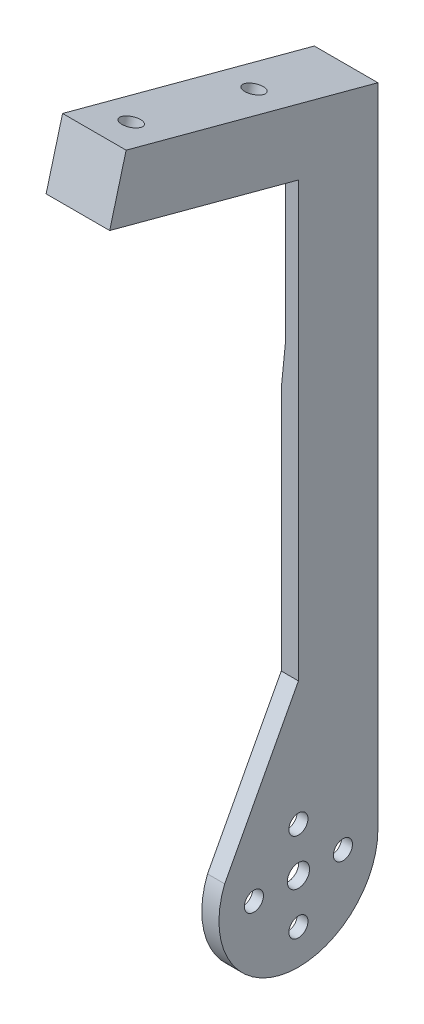
ISO-10303-21;
HEADER;
FILE_DESCRIPTION(('STEP AP214'),'2;1');
FILE_NAME('part.step','',(''),(''),'','','');
FILE_SCHEMA(('AUTOMOTIVE_DESIGN { 1 0 10303 214 1 1 1 1 }'));
ENDSEC;
DATA;
#1=APPLICATION_CONTEXT('core data for automotive mechanical design processes');
#2=APPLICATION_PROTOCOL_DEFINITION('international standard','automotive_design',2000,#1);
#3=PRODUCT_CONTEXT('',#1,'mechanical');
#4=PRODUCT('Part','Part','',(#3));
#5=PRODUCT_RELATED_PRODUCT_CATEGORY('part','',(#4));
#6=PRODUCT_DEFINITION_FORMATION('','',#4);
#7=PRODUCT_DEFINITION_CONTEXT('part definition',#1,'design');
#8=PRODUCT_DEFINITION('design','',#6,#7);
#9=PRODUCT_DEFINITION_SHAPE('','',#8);
#10=(LENGTH_UNIT() NAMED_UNIT(*) SI_UNIT(.MILLI.,.METRE.));
#11=(NAMED_UNIT(*) PLANE_ANGLE_UNIT() SI_UNIT($,.RADIAN.));
#12=(NAMED_UNIT(*) SI_UNIT($,.STERADIAN.) SOLID_ANGLE_UNIT());
#13=UNCERTAINTY_MEASURE_WITH_UNIT(LENGTH_MEASURE(1.E-05),#10,'distance_accuracy_value','');
#14=(GEOMETRIC_REPRESENTATION_CONTEXT(3) GLOBAL_UNCERTAINTY_ASSIGNED_CONTEXT((#13)) GLOBAL_UNIT_ASSIGNED_CONTEXT((#10,
#11,#12)) REPRESENTATION_CONTEXT('',''));
#15=CARTESIAN_POINT('',(0.,0.,0.));
#16=DIRECTION('',(0.,0.,1.));
#17=DIRECTION('',(1.,0.,0.));
#18=AXIS2_PLACEMENT_3D('',#15,#16,#17);
#19=CARTESIAN_POINT('',(41.627689185406,93.7654447363284,32.7931913280391));
#20=DIRECTION('',(-0.995037190209989,0.0995037190210029,0.));
#21=DIRECTION('',(0.,0.,1.));
#22=AXIS2_PLACEMENT_3D('',#19,#20,#21);
#23=PLANE('',#22);
#24=DIRECTION('',(-0.0995037190210029,-0.995037190209989,0.));
#25=VECTOR('',#24,1.);
#26=CARTESIAN_POINT('',(37.7447683933264,54.9362368155364,20.2931913280394));
#27=LINE('',#26,#25);
#28=CARTESIAN_POINT('',(41.9776891854057,97.2654447363283,20.2931913280393));
#29=VERTEX_POINT('',#28);
#30=CARTESIAN_POINT('',(41.2776891854058,90.2654447363284,20.2931913280395));
#31=VERTEX_POINT('',#30);
#32=EDGE_CURVE('E236',#29,#31,#27,.T.);
#33=ORIENTED_EDGE('',*,*,#32,.T.);
#34=DIRECTION('',(0.,0.,1.));
#35=VECTOR('',#34,1.);
#36=CARTESIAN_POINT('',(41.277689185406,90.2654447363284,32.7931913280392));
#37=LINE('',#36,#35);
#38=CARTESIAN_POINT('',(41.277689185406,90.2654447363284,32.7931913280395));
#39=VERTEX_POINT('',#38);
#40=EDGE_CURVE('E11',#31,#39,#37,.T.);
#41=ORIENTED_EDGE('',*,*,#40,.T.);
#42=DIRECTION('',(0.0995037190210029,0.995037190209989,0.));
#43=VECTOR('',#42,1.);
#44=CARTESIAN_POINT('',(43.1903129477823,109.391682360091,32.7931913280393));
#45=LINE('',#44,#43);
#46=CARTESIAN_POINT('',(41.9776891854059,97.2654447363283,32.7931913280389));
#47=VERTEX_POINT('',#46);
#48=EDGE_CURVE('E186',#39,#47,#45,.T.);
#49=ORIENTED_EDGE('',*,*,#48,.T.);
#50=DIRECTION('',(0.,0.,-1.));
#51=VECTOR('',#50,1.);
#52=CARTESIAN_POINT('',(41.9776891854057,97.2654447363283,20.2931913280393));
#53=LINE('',#52,#51);
#54=EDGE_CURVE('E235',#47,#29,#53,.T.);
#55=ORIENTED_EDGE('',*,*,#54,.T.);
#56=EDGE_LOOP('',(#33,#41,#49,#55));
#57=FACE_BOUND('',#56,.T.);
#58=ADVANCED_FACE('F36',(#57),#23,.T.);
#59=CARTESIAN_POINT('',(41.2776891854059,64.0154447363285,32.7931913280395));
#60=DIRECTION('',(-1.,0.,0.));
#61=DIRECTION('',(0.,1.,0.));
#62=AXIS2_PLACEMENT_3D('',#59,#60,#61);
#63=PLANE('',#62);
#64=CARTESIAN_POINT('',(41.2776891854056,25.2654447363286,32.7931913280394));
#65=DIRECTION('',(-1.,0.,0.));
#66=DIRECTION('',(0.,0.,1.));
#67=AXIS2_PLACEMENT_3D('',#64,#65,#66);
#68=CIRCLE('',#67,10.15);
#69=CARTESIAN_POINT('',(41.2776891854058,25.2654447363286,42.9431913280394));
#70=VERTEX_POINT('',#69);
#71=EDGE_CURVE('E251',#70,#70,#68,.T.);
#72=ORIENTED_EDGE('',*,*,#71,.F.);
#73=EDGE_LOOP('',(#72));
#74=FACE_BOUND('',#73,.T.);
#75=DIRECTION('',(0.,1.,0.));
#76=VECTOR('',#75,1.);
#77=CARTESIAN_POINT('',(41.2776891854057,27.7654447363286,32.7931913280395));
#78=LINE('',#77,#76);
#79=CARTESIAN_POINT('',(41.2776891854058,51.7654447363286,32.7931913280395));
#80=VERTEX_POINT('',#79);
#81=EDGE_CURVE('E166',#80,#39,#78,.T.);
#82=ORIENTED_EDGE('',*,*,#81,.T.);
#83=ORIENTED_EDGE('',*,*,#40,.F.);
#84=DIRECTION('',(0.,1.,0.));
#85=VECTOR('',#84,1.);
#86=CARTESIAN_POINT('',(41.2776891854059,135.265444736329,20.2931913280394));
#87=LINE('',#86,#85);
#88=CARTESIAN_POINT('',(41.2776891854055,25.2654447363286,20.2931913280395));
#89=VERTEX_POINT('',#88);
#90=EDGE_CURVE('E239',#89,#31,#87,.T.);
#91=ORIENTED_EDGE('',*,*,#90,.F.);
#92=CARTESIAN_POINT('',(41.2776891854057,25.2654447363286,32.7931913280395));
#93=DIRECTION('',(-1.,0.,0.));
#94=DIRECTION('',(0.,0.,-1.));
#95=AXIS2_PLACEMENT_3D('',#92,#93,#94);
#96=CIRCLE('',#95,12.5);
#97=CARTESIAN_POINT('',(41.2776891854059,29.9254447363286,44.3920878272759));
#98=VERTEX_POINT('',#97);
#99=EDGE_CURVE('E169',#89,#98,#96,.T.);
#100=ORIENTED_EDGE('',*,*,#99,.T.);
#101=DIRECTION('',(0.,-0.883176086632785,0.469041575982343));
#102=VECTOR('',#101,1.);
#103=CARTESIAN_POINT('',(41.2776891854058,54.9829447363286,31.0844253259198));
#104=LINE('',#103,#102);
#105=EDGE_CURVE('E162',#80,#98,#104,.T.);
#106=ORIENTED_EDGE('',*,*,#105,.F.);
#107=EDGE_LOOP('',(#82,#83,#91,#100,#106));
#108=FACE_BOUND('',#107,.T.);
#109=ADVANCED_FACE('F164',(#74,#108),#63,.T.);
#110=CARTESIAN_POINT('',(42.2776891854058,74.0154447363286,32.7931913280394));
#111=DIRECTION('',(1.,0.,0.));
#112=DIRECTION('',(0.,0.,-1.));
#113=AXIS2_PLACEMENT_3D('',#110,#111,#112);
#114=PLANE('',#113);
#115=CARTESIAN_POINT('',(42.2776891854057,25.2654447363286,39.7931914323475));
#116=DIRECTION('',(-1.,0.,0.));
#117=DIRECTION('',(0.,-1.,0.));
#118=AXIS2_PLACEMENT_3D('',#115,#116,#117);
#119=CIRCLE('',#118,1.5);
#120=CARTESIAN_POINT('',(42.2776891854057,26.7654447363286,39.7931914323475));
#121=VERTEX_POINT('',#120);
#122=EDGE_CURVE('E227',#121,#121,#119,.T.);
#123=ORIENTED_EDGE('',*,*,#122,.F.);
#124=EDGE_LOOP('',(#123));
#125=FACE_BOUND('',#124,.T.);
#126=CARTESIAN_POINT('',(42.2776891854056,32.2654448406367,32.7931913280394));
#127=DIRECTION('',(-1.,0.,0.));
#128=DIRECTION('',(0.,-1.,0.));
#129=AXIS2_PLACEMENT_3D('',#126,#127,#128);
#130=CIRCLE('',#129,1.5);
#131=CARTESIAN_POINT('',(42.2776891854056,33.7654448406367,32.7931913280394));
#132=VERTEX_POINT('',#131);
#133=EDGE_CURVE('E226',#132,#132,#130,.T.);
#134=ORIENTED_EDGE('',*,*,#133,.F.);
#135=EDGE_LOOP('',(#134));
#136=FACE_BOUND('',#135,.T.);
#137=CARTESIAN_POINT('',(42.2776891854055,25.2654447363286,25.7931912237313));
#138=DIRECTION('',(-1.,0.,0.));
#139=DIRECTION('',(0.,-1.,0.));
#140=AXIS2_PLACEMENT_3D('',#137,#138,#139);
#141=CIRCLE('',#140,1.5);
#142=CARTESIAN_POINT('',(42.2776891854055,26.7654447363286,25.7931912237313));
#143=VERTEX_POINT('',#142);
#144=EDGE_CURVE('E278',#143,#143,#141,.T.);
#145=ORIENTED_EDGE('',*,*,#144,.F.);
#146=EDGE_LOOP('',(#145));
#147=FACE_BOUND('',#146,.T.);
#148=CARTESIAN_POINT('',(42.2776891854056,25.2654447363286,32.7931913280394));
#149=DIRECTION('',(-1.,0.,0.));
#150=DIRECTION('',(0.,-1.,0.));
#151=AXIS2_PLACEMENT_3D('',#148,#149,#150);
#152=CIRCLE('',#151,1.75);
#153=CARTESIAN_POINT('',(42.2776891854056,27.0154447363286,32.7931913280394));
#154=VERTEX_POINT('',#153);
#155=EDGE_CURVE('E222',#154,#154,#152,.T.);
#156=ORIENTED_EDGE('',*,*,#155,.F.);
#157=EDGE_LOOP('',(#156));
#158=FACE_BOUND('',#157,.T.);
#159=CARTESIAN_POINT('',(42.2776891854056,18.2654446320205,32.7931913280394));
#160=DIRECTION('',(-1.,0.,0.));
#161=DIRECTION('',(0.,-1.,0.));
#162=AXIS2_PLACEMENT_3D('',#159,#160,#161);
#163=CIRCLE('',#162,1.5);
#164=CARTESIAN_POINT('',(42.2776891854056,19.7654446320205,32.7931913280394));
#165=VERTEX_POINT('',#164);
#166=EDGE_CURVE('E46',#165,#165,#163,.T.);
#167=ORIENTED_EDGE('',*,*,#166,.F.);
#168=EDGE_LOOP('',(#167));
#169=FACE_BOUND('',#168,.T.);
#170=CARTESIAN_POINT('',(42.2776891854056,25.2654447363286,32.7931913280394));
#171=DIRECTION('',(-1.,0.,0.));
#172=DIRECTION('',(0.,0.,1.));
#173=AXIS2_PLACEMENT_3D('',#170,#171,#172);
#174=CIRCLE('',#173,10.15);
#175=CARTESIAN_POINT('',(42.2776891854058,25.2654447363286,42.9431913280394));
#176=VERTEX_POINT('',#175);
#177=EDGE_CURVE('E586',#176,#176,#174,.T.);
#178=ORIENTED_EDGE('',*,*,#177,.T.);
#179=EDGE_LOOP('',(#178));
#180=FACE_BOUND('',#179,.T.);
#181=ADVANCED_FACE('F373',(#125,#136,#147,#158,#169,#180),#114,.F.);
#182=CARTESIAN_POINT('',(42.2776891854056,18.2654446320205,32.7931913280394));
#183=DIRECTION('',(1.,0.,0.));
#184=DIRECTION('',(0.,-1.,0.));
#185=AXIS2_PLACEMENT_3D('',#182,#183,#184);
#186=CYLINDRICAL_SURFACE('',#185,1.5);
#187=CARTESIAN_POINT('',(43.9776891854056,18.2654446320205,32.7931913280394));
#188=DIRECTION('',(1.,0.,0.));
#189=DIRECTION('',(0.,-1.,0.));
#190=AXIS2_PLACEMENT_3D('',#187,#188,#189);
#191=CIRCLE('',#190,1.5);
#192=CARTESIAN_POINT('',(43.9776891854056,19.7654446320205,32.7931913280394));
#193=VERTEX_POINT('',#192);
#194=EDGE_CURVE('E262',#193,#193,#191,.T.);
#195=ORIENTED_EDGE('',*,*,#194,.T.);
#196=DIRECTION('',(-1.,0.,0.));
#197=VECTOR('',#196,1.);
#198=CARTESIAN_POINT('',(42.2776891854056,19.7654446320205,32.7931913280394));
#199=LINE('',#198,#197);
#200=EDGE_CURVE('E220',#193,#165,#199,.T.);
#201=ORIENTED_EDGE('',*,*,#200,.T.);
#202=ORIENTED_EDGE('',*,*,#166,.T.);
#203=ORIENTED_EDGE('',*,*,#200,.F.);
#204=EDGE_LOOP('',(#195,#201,#202,#203));
#205=FACE_BOUND('',#204,.T.);
#206=ADVANCED_FACE('F38',(#205),#186,.F.);
#207=CARTESIAN_POINT('',(42.2776891854056,25.2654447363286,32.7931913280394));
#208=DIRECTION('',(1.,0.,0.));
#209=DIRECTION('',(0.,-1.,0.));
#210=AXIS2_PLACEMENT_3D('',#207,#208,#209);
#211=CYLINDRICAL_SURFACE('',#210,1.75);
#212=CARTESIAN_POINT('',(43.9776891854056,25.2654447363286,32.7931913280394));
#213=DIRECTION('',(1.,0.,0.));
#214=DIRECTION('',(0.,-1.,0.));
#215=AXIS2_PLACEMENT_3D('',#212,#213,#214);
#216=CIRCLE('',#215,1.75);
#217=CARTESIAN_POINT('',(43.9776891854056,27.0154447363286,32.7931913280394));
#218=VERTEX_POINT('',#217);
#219=EDGE_CURVE('E265',#218,#218,#216,.T.);
#220=ORIENTED_EDGE('',*,*,#219,.T.);
#221=DIRECTION('',(-1.,0.,0.));
#222=VECTOR('',#221,1.);
#223=CARTESIAN_POINT('',(42.2776891854056,27.0154447363286,32.7931913280394));
#224=LINE('',#223,#222);
#225=EDGE_CURVE('E270',#218,#154,#224,.T.);
#226=ORIENTED_EDGE('',*,*,#225,.T.);
#227=ORIENTED_EDGE('',*,*,#155,.T.);
#228=ORIENTED_EDGE('',*,*,#225,.F.);
#229=EDGE_LOOP('',(#220,#226,#227,#228));
#230=FACE_BOUND('',#229,.T.);
#231=ADVANCED_FACE('F422',(#230),#211,.F.);
#232=CARTESIAN_POINT('',(42.2776891854055,25.2654447363286,25.7931912237313));
#233=DIRECTION('',(1.,0.,0.));
#234=DIRECTION('',(0.,-1.,0.));
#235=AXIS2_PLACEMENT_3D('',#232,#233,#234);
#236=CYLINDRICAL_SURFACE('',#235,1.5);
#237=CARTESIAN_POINT('',(43.9776891854055,25.2654447363286,25.7931912237313));
#238=DIRECTION('',(1.,0.,0.));
#239=DIRECTION('',(0.,-1.,0.));
#240=AXIS2_PLACEMENT_3D('',#237,#238,#239);
#241=CIRCLE('',#240,1.5);
#242=CARTESIAN_POINT('',(43.9776891854055,26.7654447363286,25.7931912237313));
#243=VERTEX_POINT('',#242);
#244=EDGE_CURVE('E296',#243,#243,#241,.T.);
#245=ORIENTED_EDGE('',*,*,#244,.T.);
#246=DIRECTION('',(-1.,0.,0.));
#247=VECTOR('',#246,1.);
#248=CARTESIAN_POINT('',(42.2776891854055,26.7654447363286,25.7931912237313));
#249=LINE('',#248,#247);
#250=EDGE_CURVE('E267',#243,#143,#249,.T.);
#251=ORIENTED_EDGE('',*,*,#250,.T.);
#252=ORIENTED_EDGE('',*,*,#144,.T.);
#253=ORIENTED_EDGE('',*,*,#250,.F.);
#254=EDGE_LOOP('',(#245,#251,#252,#253));
#255=FACE_BOUND('',#254,.T.);
#256=ADVANCED_FACE('F378',(#255),#236,.F.);
#257=CARTESIAN_POINT('',(42.2776891854056,32.2654448406367,32.7931913280394));
#258=DIRECTION('',(1.,0.,0.));
#259=DIRECTION('',(0.,-1.,0.));
#260=AXIS2_PLACEMENT_3D('',#257,#258,#259);
#261=CYLINDRICAL_SURFACE('',#260,1.5);
#262=CARTESIAN_POINT('',(43.9776891854056,32.2654448406367,32.7931913280394));
#263=DIRECTION('',(1.,0.,0.));
#264=DIRECTION('',(0.,-1.,0.));
#265=AXIS2_PLACEMENT_3D('',#262,#263,#264);
#266=CIRCLE('',#265,1.5);
#267=CARTESIAN_POINT('',(43.9776891854056,33.7654448406367,32.7931913280394));
#268=VERTEX_POINT('',#267);
#269=EDGE_CURVE('E195',#268,#268,#266,.T.);
#270=ORIENTED_EDGE('',*,*,#269,.T.);
#271=DIRECTION('',(-1.,0.,0.));
#272=VECTOR('',#271,1.);
#273=CARTESIAN_POINT('',(42.2776891854056,33.7654448406367,32.7931913280394));
#274=LINE('',#273,#272);
#275=EDGE_CURVE('E223',#268,#132,#274,.T.);
#276=ORIENTED_EDGE('',*,*,#275,.T.);
#277=ORIENTED_EDGE('',*,*,#133,.T.);
#278=ORIENTED_EDGE('',*,*,#275,.F.);
#279=EDGE_LOOP('',(#270,#276,#277,#278));
#280=FACE_BOUND('',#279,.T.);
#281=ADVANCED_FACE('F397',(#280),#261,.F.);
#282=CARTESIAN_POINT('',(42.2776891854057,25.2654447363286,39.7931914323475));
#283=DIRECTION('',(1.,0.,0.));
#284=DIRECTION('',(0.,-1.,0.));
#285=AXIS2_PLACEMENT_3D('',#282,#283,#284);
#286=CYLINDRICAL_SURFACE('',#285,1.5);
#287=CARTESIAN_POINT('',(43.9776891854057,25.2654447363286,39.7931914323474));
#288=DIRECTION('',(1.,0.,0.));
#289=DIRECTION('',(0.,-1.,0.));
#290=AXIS2_PLACEMENT_3D('',#287,#288,#289);
#291=CIRCLE('',#290,1.5);
#292=CARTESIAN_POINT('',(43.9776891854057,26.7654447363286,39.7931914323474));
#293=VERTEX_POINT('',#292);
#294=EDGE_CURVE('E188',#293,#293,#291,.T.);
#295=ORIENTED_EDGE('',*,*,#294,.T.);
#296=DIRECTION('',(-1.,0.,0.));
#297=VECTOR('',#296,1.);
#298=CARTESIAN_POINT('',(42.2776891854057,26.7654447363286,39.7931914323475));
#299=LINE('',#298,#297);
#300=EDGE_CURVE('E173',#293,#121,#299,.T.);
#301=ORIENTED_EDGE('',*,*,#300,.T.);
#302=ORIENTED_EDGE('',*,*,#122,.T.);
#303=ORIENTED_EDGE('',*,*,#300,.F.);
#304=EDGE_LOOP('',(#295,#301,#302,#303));
#305=FACE_BOUND('',#304,.T.);
#306=ADVANCED_FACE('F384',(#305),#286,.F.);
#307=CARTESIAN_POINT('',(42.2776891854057,40.8454447363286,38.5926395776576));
#308=DIRECTION('',(0.,0.469041575982343,0.883176086632785));
#309=DIRECTION('',(1.,0.,0.));
#310=AXIS2_PLACEMENT_3D('',#307,#308,#309);
#311=PLANE('',#310);
#312=DIRECTION('',(0.,0.883176086632785,-0.469041575982343));
#313=VECTOR('',#312,1.);
#314=CARTESIAN_POINT('',(43.9776891854057,54.9829447363286,31.0844253259197));
#315=LINE('',#314,#313);
#316=CARTESIAN_POINT('',(43.9776891854058,29.9254447363286,44.3920878272758));
#317=VERTEX_POINT('',#316);
#318=CARTESIAN_POINT('',(43.9776891854057,51.7654447363286,32.7931913280393));
#319=VERTEX_POINT('',#318);
#320=EDGE_CURVE('E179',#317,#319,#315,.T.);
#321=ORIENTED_EDGE('',*,*,#320,.T.);
#322=DIRECTION('',(-1.,0.,0.));
#323=VECTOR('',#322,1.);
#324=CARTESIAN_POINT('',(42.2776891854057,51.7654447363286,32.7931913280394));
#325=LINE('',#324,#323);
#326=EDGE_CURVE('E176',#319,#80,#325,.T.);
#327=ORIENTED_EDGE('',*,*,#326,.T.);
#328=ORIENTED_EDGE('',*,*,#105,.T.);
#329=DIRECTION('',(1.,0.,0.));
#330=VECTOR('',#329,1.);
#331=CARTESIAN_POINT('',(42.2776891854058,29.9254447363286,44.3920878272759));
#332=LINE('',#331,#330);
#333=EDGE_CURVE('E182',#98,#317,#332,.T.);
#334=ORIENTED_EDGE('',*,*,#333,.T.);
#335=EDGE_LOOP('',(#321,#327,#328,#334));
#336=FACE_BOUND('',#335,.T.);
#337=ADVANCED_FACE('F177',(#336),#311,.T.);
#338=CARTESIAN_POINT('',(42.2776891854056,25.2654447363286,32.7931913280394));
#339=DIRECTION('',(1.,0.,0.));
#340=DIRECTION('',(0.,-1.,0.));
#341=AXIS2_PLACEMENT_3D('',#338,#339,#340);
#342=CYLINDRICAL_SURFACE('',#341,12.5);
#343=CARTESIAN_POINT('',(43.9776891854056,25.2654447363286,32.7931913280394));
#344=DIRECTION('',(-1.,0.,0.));
#345=DIRECTION('',(0.,-1.,0.));
#346=AXIS2_PLACEMENT_3D('',#343,#344,#345);
#347=CIRCLE('',#346,12.5);
#348=CARTESIAN_POINT('',(43.9776891854054,25.2654447363286,20.2931913280394));
#349=VERTEX_POINT('',#348);
#350=EDGE_CURVE('E273',#349,#317,#347,.T.);
#351=ORIENTED_EDGE('',*,*,#350,.T.);
#352=ORIENTED_EDGE('',*,*,#333,.F.);
#353=ORIENTED_EDGE('',*,*,#99,.F.);
#354=DIRECTION('',(1.,0.,0.));
#355=VECTOR('',#354,1.);
#356=CARTESIAN_POINT('',(42.2776891854054,25.2654447363286,20.2931913280394));
#357=LINE('',#356,#355);
#358=EDGE_CURVE('E297',#89,#349,#357,.T.);
#359=ORIENTED_EDGE('',*,*,#358,.T.);
#360=EDGE_LOOP('',(#351,#352,#353,#359));
#361=FACE_BOUND('',#360,.T.);
#362=ADVANCED_FACE('F318',(#361),#342,.T.);
#363=CARTESIAN_POINT('',(42.277689185406,125.265444736329,32.7931913280393));
#364=DIRECTION('',(0.,0.,1.));
#365=DIRECTION('',(1.,0.,0.));
#366=AXIS2_PLACEMENT_3D('',#363,#364,#365);
#367=PLANE('',#366);
#368=DIRECTION('',(0.,-1.,0.));
#369=VECTOR('',#368,1.);
#370=CARTESIAN_POINT('',(41.9776891854059,119.515444736329,32.7931913280393));
#371=LINE('',#370,#369);
#372=CARTESIAN_POINT('',(41.9776891854059,120.035434560835,32.7931913280393));
#373=VERTEX_POINT('',#372);
#374=EDGE_CURVE('E230',#373,#47,#371,.T.);
#375=ORIENTED_EDGE('',*,*,#374,.T.);
#376=ORIENTED_EDGE('',*,*,#48,.F.);
#377=ORIENTED_EDGE('',*,*,#81,.F.);
#378=ORIENTED_EDGE('',*,*,#326,.F.);
#379=DIRECTION('',(0.,1.,0.));
#380=VECTOR('',#379,1.);
#381=CARTESIAN_POINT('',(43.9776891854059,94.6404447363285,32.7931913280393));
#382=LINE('',#381,#380);
#383=CARTESIAN_POINT('',(43.977689185406,120.035434560835,32.7931913280393));
#384=VERTEX_POINT('',#383);
#385=EDGE_CURVE('E228',#319,#384,#382,.T.);
#386=ORIENTED_EDGE('',*,*,#385,.T.);
#387=DIRECTION('',(1.,0.,0.));
#388=VECTOR('',#387,1.);
#389=CARTESIAN_POINT('',(42.2026891854058,120.035434560835,32.7931913280393));
#390=LINE('',#389,#388);
#391=EDGE_CURVE('E206',#373,#384,#390,.T.);
#392=ORIENTED_EDGE('',*,*,#391,.F.);
#393=EDGE_LOOP('',(#375,#376,#377,#378,#386,#392));
#394=FACE_BOUND('',#393,.T.);
#395=ADVANCED_FACE('F185',(#394),#367,.T.);
#396=CARTESIAN_POINT('',(42.2776891854061,132.638511695274,41.2931913280397));
#397=DIRECTION('',(0.,0.965925826289069,-0.258819045102517));
#398=DIRECTION('',(-1.,0.,0.));
#399=AXIS2_PLACEMENT_3D('',#396,#397,#398);
#400=PLANE('',#399);
#401=CARTESIAN_POINT('',(38.9776891854056,136.070245232809,54.1005952481575));
#402=DIRECTION('',(0.,-0.965925826289069,0.258819045102517));
#403=DIRECTION('',(1.,0.,0.));
#404=AXIS2_PLACEMENT_3D('',#401,#402,#403);
#405=CIRCLE('',#404,1.5);
#406=CARTESIAN_POINT('',(37.4776891854056,136.070245232809,54.1005952481576));
#407=VERTEX_POINT('',#406);
#408=EDGE_CURVE('E215',#407,#407,#405,.T.);
#409=ORIENTED_EDGE('',*,*,#408,.T.);
#410=EDGE_LOOP('',(#409));
#411=FACE_BOUND('',#410,.T.);
#412=CARTESIAN_POINT('',(38.977689185405,130.893864330759,34.7820787223761));
#413=DIRECTION('',(0.,-0.965925826289069,0.258819045102517));
#414=DIRECTION('',(1.,0.,0.));
#415=AXIS2_PLACEMENT_3D('',#412,#413,#414);
#416=CIRCLE('',#415,1.5);
#417=CARTESIAN_POINT('',(37.477689185405,130.893864330758,34.7820787223762));
#418=VERTEX_POINT('',#417);
#419=EDGE_CURVE('E247',#418,#418,#416,.T.);
#420=ORIENTED_EDGE('',*,*,#419,.T.);
#421=EDGE_LOOP('',(#420));
#422=FACE_BOUND('',#421,.T.);
#423=DIRECTION('',(1.,0.,0.));
#424=VECTOR('',#423,1.);
#425=CARTESIAN_POINT('',(42.1276891854062,137.623159503425,59.8961502058938));
#426=LINE('',#425,#424);
#427=CARTESIAN_POINT('',(33.977689185406,137.623159503424,59.896150205894));
#428=VERTEX_POINT('',#427);
#429=CARTESIAN_POINT('',(43.9776891854065,137.623159503424,59.8961502058938));
#430=VERTEX_POINT('',#429);
#431=EDGE_CURVE('E200',#428,#430,#426,.T.);
#432=ORIENTED_EDGE('',*,*,#431,.T.);
#433=DIRECTION('',(0.,-0.258819045102517,-0.965925826289069));
#434=VECTOR('',#433,1.);
#435=CARTESIAN_POINT('',(43.9776891854059,129.27757477355,28.7500039751295));
#436=LINE('',#435,#434);
#437=CARTESIAN_POINT('',(43.9776891854054,127.011578654221,20.29319132804));
#438=VERTEX_POINT('',#437);
#439=EDGE_CURVE('E266',#430,#438,#436,.T.);
#440=ORIENTED_EDGE('',*,*,#439,.T.);
#441=DIRECTION('',(-1.,0.,0.));
#442=VECTOR('',#441,1.);
#443=CARTESIAN_POINT('',(42.2776891854057,127.011578654221,20.2931913280393));
#444=LINE('',#443,#442);
#445=CARTESIAN_POINT('',(33.9776891854053,127.01157865422,20.2931913280402));
#446=VERTEX_POINT('',#445);
#447=EDGE_CURVE('E255',#438,#446,#444,.T.);
#448=ORIENTED_EDGE('',*,*,#447,.T.);
#449=DIRECTION('',(0.,0.258819045102529,0.965925826289066));
#450=VECTOR('',#449,1.);
#451=CARTESIAN_POINT('',(33.9776891854059,136.329064277912,55.0665210744486));
#452=LINE('',#451,#450);
#453=EDGE_CURVE('E202',#446,#428,#452,.T.);
#454=ORIENTED_EDGE('',*,*,#453,.T.);
#455=EDGE_LOOP('',(#432,#440,#448,#454));
#456=FACE_BOUND('',#455,.T.);
#457=ADVANCED_FACE('F343',(#411,#422,#456),#400,.T.);
#458=CARTESIAN_POINT('',(43.9776891854058,64.0154447363285,32.7931913280393));
#459=DIRECTION('',(1.,0.,0.));
#460=DIRECTION('',(0.,0.,-1.));
#461=AXIS2_PLACEMENT_3D('',#458,#459,#460);
#462=PLANE('',#461);
#463=ORIENTED_EDGE('',*,*,#294,.F.);
#464=EDGE_LOOP('',(#463));
#465=FACE_BOUND('',#464,.T.);
#466=ORIENTED_EDGE('',*,*,#269,.F.);
#467=EDGE_LOOP('',(#466));
#468=FACE_BOUND('',#467,.T.);
#469=ORIENTED_EDGE('',*,*,#244,.F.);
#470=EDGE_LOOP('',(#469));
#471=FACE_BOUND('',#470,.T.);
#472=ORIENTED_EDGE('',*,*,#219,.F.);
#473=EDGE_LOOP('',(#472));
#474=FACE_BOUND('',#473,.T.);
#475=ORIENTED_EDGE('',*,*,#194,.F.);
#476=EDGE_LOOP('',(#475));
#477=FACE_BOUND('',#476,.T.);
#478=DIRECTION('',(0.,-0.965925826289066,0.25881904510253));
#479=VECTOR('',#478,1.);
#480=CARTESIAN_POINT('',(43.9776891854065,101.842933814231,69.4834327843169));
#481=LINE('',#480,#479);
#482=CARTESIAN_POINT('',(43.9776891854065,127.963901240534,62.4843406569191));
#483=VERTEX_POINT('',#482);
#484=EDGE_CURVE('E197',#430,#483,#481,.T.);
#485=ORIENTED_EDGE('',*,*,#484,.T.);
#486=DIRECTION('',(0.,-0.25881904510252,-0.965925826289069));
#487=VECTOR('',#486,1.);
#488=CARTESIAN_POINT('',(43.9776891854059,118.132780672221,25.7940992006421));
#489=LINE('',#488,#487);
#490=CARTESIAN_POINT('',(43.977689185406,120.023464436452,32.8502270697976));
#491=VERTEX_POINT('',#490);
#492=EDGE_CURVE('E205',#483,#491,#489,.T.);
#493=ORIENTED_EDGE('',*,*,#492,.T.);
#494=DIRECTION('',(0.,-0.205395924829215,0.978678963738136));
#495=VECTOR('',#494,1.);
#496=CARTESIAN_POINT('',(43.977689185406,119.50661633562,35.3129261917666));
#497=LINE('',#496,#495);
#498=EDGE_CURVE('E209',#384,#491,#497,.T.);
#499=ORIENTED_EDGE('',*,*,#498,.F.);
#500=ORIENTED_EDGE('',*,*,#385,.F.);
#501=ORIENTED_EDGE('',*,*,#320,.F.);
#502=ORIENTED_EDGE('',*,*,#350,.F.);
#503=DIRECTION('',(0.,1.,0.));
#504=VECTOR('',#503,1.);
#505=CARTESIAN_POINT('',(43.9776891854054,130.265444736328,20.29319132804));
#506=LINE('',#505,#504);
#507=EDGE_CURVE('E40',#349,#438,#506,.T.);
#508=ORIENTED_EDGE('',*,*,#507,.T.);
#509=ORIENTED_EDGE('',*,*,#439,.F.);
#510=EDGE_LOOP('',(#485,#493,#499,#500,#501,#502,#508,#509));
#511=FACE_BOUND('',#510,.T.);
#512=ADVANCED_FACE('F323',(#465,#468,#471,#474,#477,#511),#462,.T.);
#513=CARTESIAN_POINT('',(41.9776891854057,113.765444736328,20.1015169184121));
#514=DIRECTION('',(-1.,0.,0.));
#515=DIRECTION('',(0.,1.,0.));
#516=AXIS2_PLACEMENT_3D('',#513,#514,#515);
#517=PLANE('',#516);
#518=DIRECTION('',(0.,-1.,0.));
#519=VECTOR('',#518,1.);
#520=CARTESIAN_POINT('',(41.9776891854057,111.015444736328,20.2931913280397));
#521=LINE('',#520,#519);
#522=CARTESIAN_POINT('',(41.9776891854057,125.658816850119,20.2931913280393));
#523=VERTEX_POINT('',#522);
#524=EDGE_CURVE('E232',#523,#29,#521,.T.);
#525=ORIENTED_EDGE('',*,*,#524,.T.);
#526=ORIENTED_EDGE('',*,*,#54,.F.);
#527=ORIENTED_EDGE('',*,*,#374,.F.);
#528=DIRECTION('',(0.,0.205395924829215,-0.978678963738136));
#529=VECTOR('',#528,1.);
#530=CARTESIAN_POINT('',(41.9776891854058,121.83164911707,24.2345142169473));
#531=LINE('',#530,#529);
#532=CARTESIAN_POINT('',(41.9776891854058,122.042629075631,23.2292282192537));
#533=VERTEX_POINT('',#532);
#534=EDGE_CURVE('E192',#373,#533,#531,.T.);
#535=ORIENTED_EDGE('',*,*,#534,.T.);
#536=DIRECTION('',(0.,-0.77633624314121,0.630318996687703));
#537=VECTOR('',#536,1.);
#538=CARTESIAN_POINT('',(41.9776891854058,121.217611265034,23.899072508013));
#539=LINE('',#538,#537);
#540=EDGE_CURVE('E254',#523,#533,#539,.T.);
#541=ORIENTED_EDGE('',*,*,#540,.F.);
#542=EDGE_LOOP('',(#525,#526,#527,#535,#541));
#543=FACE_BOUND('',#542,.T.);
#544=ADVANCED_FACE('F333',(#543),#517,.T.);
#545=CARTESIAN_POINT('',(42.2776891854054,15.2654447363285,20.2931913280394));
#546=DIRECTION('',(0.,0.,-1.));
#547=DIRECTION('',(-1.,0.,0.));
#548=AXIS2_PLACEMENT_3D('',#545,#546,#547);
#549=PLANE('',#548);
#550=DIRECTION('',(1.,0.,0.));
#551=VECTOR('',#550,1.);
#552=CARTESIAN_POINT('',(42.2026891854056,125.658816850119,20.2931913280393));
#553=LINE('',#552,#551);
#554=CARTESIAN_POINT('',(33.9776891854053,125.658816850119,20.2931913280402));
#555=VERTEX_POINT('',#554);
#556=EDGE_CURVE('E281',#555,#523,#553,.T.);
#557=ORIENTED_EDGE('',*,*,#556,.F.);
#558=DIRECTION('',(0.,-1.,0.));
#559=VECTOR('',#558,1.);
#560=CARTESIAN_POINT('',(33.9776891854053,127.01157865422,20.2931913280402));
#561=LINE('',#560,#559);
#562=EDGE_CURVE('E204',#446,#555,#561,.T.);
#563=ORIENTED_EDGE('',*,*,#562,.F.);
#564=ORIENTED_EDGE('',*,*,#447,.F.);
#565=ORIENTED_EDGE('',*,*,#507,.F.);
#566=ORIENTED_EDGE('',*,*,#358,.F.);
#567=ORIENTED_EDGE('',*,*,#90,.T.);
#568=ORIENTED_EDGE('',*,*,#32,.F.);
#569=ORIENTED_EDGE('',*,*,#524,.F.);
#570=EDGE_LOOP('',(#557,#563,#564,#565,#566,#567,#568,#569));
#571=FACE_BOUND('',#570,.T.);
#572=ADVANCED_FACE('F337',(#571),#549,.T.);
#573=CARTESIAN_POINT('',(42.1276891854056,121.341140643285,26.5717091989185));
#574=DIRECTION('',(0.,-0.978678963738136,-0.205395924829215));
#575=DIRECTION('',(0.,0.205395924829215,-0.978678963738136));
#576=AXIS2_PLACEMENT_3D('',#573,#574,#575);
#577=PLANE('',#576);
#578=DIRECTION('',(-1.,0.,0.));
#579=VECTOR('',#578,1.);
#580=CARTESIAN_POINT('',(42.2026891854057,122.042629075631,23.2292282192537));
#581=LINE('',#580,#579);
#582=CARTESIAN_POINT('',(33.9776891854053,122.042629075631,23.2292282192538));
#583=VERTEX_POINT('',#582);
#584=EDGE_CURVE('E252',#533,#583,#581,.T.);
#585=ORIENTED_EDGE('',*,*,#584,.F.);
#586=ORIENTED_EDGE('',*,*,#534,.F.);
#587=ORIENTED_EDGE('',*,*,#391,.T.);
#588=ORIENTED_EDGE('',*,*,#498,.T.);
#589=DIRECTION('',(-1.,0.,0.));
#590=VECTOR('',#589,1.);
#591=CARTESIAN_POINT('',(42.1276891854057,120.023464436452,32.8502270697977));
#592=LINE('',#591,#590);
#593=CARTESIAN_POINT('',(33.9776891854055,120.023464436451,32.850227069798));
#594=VERTEX_POINT('',#593);
#595=EDGE_CURVE('E213',#491,#594,#592,.T.);
#596=ORIENTED_EDGE('',*,*,#595,.T.);
#597=DIRECTION('',(0.,0.205395924829215,-0.978678963738136));
#598=VECTOR('',#597,1.);
#599=CARTESIAN_POINT('',(33.9776891854055,120.203303758411,31.9933212601975));
#600=LINE('',#599,#598);
#601=EDGE_CURVE('E260',#594,#583,#600,.T.);
#602=ORIENTED_EDGE('',*,*,#601,.T.);
#603=EDGE_LOOP('',(#585,#586,#587,#588,#596,#602));
#604=FACE_BOUND('',#603,.T.);
#605=ADVANCED_FACE('F330',(#604),#577,.T.);
#606=CARTESIAN_POINT('',(42.2026891854057,123.850722962875,21.7612097736465));
#607=DIRECTION('',(0.,-0.630318996687703,-0.77633624314121));
#608=DIRECTION('',(0.,-0.77633624314121,0.630318996687703));
#609=AXIS2_PLACEMENT_3D('',#606,#607,#608);
#610=PLANE('',#609);
#611=DIRECTION('',(0.,0.77633624314121,-0.630318996687703));
#612=VECTOR('',#611,1.);
#613=CARTESIAN_POINT('',(33.9776891854054,120.435816853048,24.5338230735479));
#614=LINE('',#613,#612);
#615=EDGE_CURVE('E258',#583,#555,#614,.T.);
#616=ORIENTED_EDGE('',*,*,#615,.T.);
#617=ORIENTED_EDGE('',*,*,#556,.T.);
#618=ORIENTED_EDGE('',*,*,#540,.T.);
#619=ORIENTED_EDGE('',*,*,#584,.T.);
#620=EDGE_LOOP('',(#616,#617,#618,#619));
#621=FACE_BOUND('',#620,.T.);
#622=ADVANCED_FACE('F357',(#621),#610,.T.);
#623=CARTESIAN_POINT('',(33.9776891854056,126.493940564015,38.9739514267572));
#624=DIRECTION('',(-1.,0.,0.));
#625=DIRECTION('',(0.,1.,0.));
#626=AXIS2_PLACEMENT_3D('',#623,#624,#625);
#627=PLANE('',#626);
#628=DIRECTION('',(0.,0.965925826289066,-0.25881904510253));
#629=VECTOR('',#628,1.);
#630=CARTESIAN_POINT('',(33.977689185406,130.216953903067,61.8806370154887));
#631=LINE('',#630,#629);
#632=CARTESIAN_POINT('',(33.977689185406,127.963901240533,62.4843406569195));
#633=VERTEX_POINT('',#632);
#634=EDGE_CURVE('E244',#633,#428,#631,.T.);
#635=ORIENTED_EDGE('',*,*,#634,.T.);
#636=ORIENTED_EDGE('',*,*,#453,.F.);
#637=ORIENTED_EDGE('',*,*,#562,.T.);
#638=ORIENTED_EDGE('',*,*,#615,.F.);
#639=ORIENTED_EDGE('',*,*,#601,.F.);
#640=DIRECTION('',(0.,0.25881904510252,0.965925826289069));
#641=VECTOR('',#640,1.);
#642=CARTESIAN_POINT('',(33.9776891854055,120.008181755508,32.7931913280404));
#643=LINE('',#642,#641);
#644=EDGE_CURVE('E211',#594,#633,#643,.T.);
#645=ORIENTED_EDGE('',*,*,#644,.T.);
#646=EDGE_LOOP('',(#635,#636,#637,#638,#639,#645));
#647=FACE_BOUND('',#646,.T.);
#648=ADVANCED_FACE('F355',(#647),#627,.T.);
#649=CARTESIAN_POINT('',(41.9776891854055,120.008181755508,32.7931913280398));
#650=DIRECTION('',(0.,0.965925826289069,-0.25881904510252));
#651=DIRECTION('',(-1.,0.,0.));
#652=AXIS2_PLACEMENT_3D('',#649,#650,#651);
#653=PLANE('',#652);
#654=CARTESIAN_POINT('',(38.9776891854056,126.410986969918,56.6887856991828));
#655=DIRECTION('',(0.,0.965925826289069,-0.25881904510252));
#656=DIRECTION('',(1.,0.,0.));
#657=AXIS2_PLACEMENT_3D('',#654,#655,#656);
#658=CIRCLE('',#657,1.5);
#659=CARTESIAN_POINT('',(37.4776891854056,126.410986969918,56.6887856991828));
#660=VERTEX_POINT('',#659);
#661=EDGE_CURVE('E201',#660,#660,#658,.T.);
#662=ORIENTED_EDGE('',*,*,#661,.T.);
#663=EDGE_LOOP('',(#662));
#664=FACE_BOUND('',#663,.T.);
#665=CARTESIAN_POINT('',(38.977689185405,121.234606067867,37.3702691734014));
#666=DIRECTION('',(0.,0.965925826289069,-0.25881904510252));
#667=DIRECTION('',(1.,0.,0.));
#668=AXIS2_PLACEMENT_3D('',#665,#666,#667);
#669=CIRCLE('',#668,1.5);
#670=CARTESIAN_POINT('',(37.477689185405,121.234606067867,37.3702691734014));
#671=VERTEX_POINT('',#670);
#672=EDGE_CURVE('E219',#671,#671,#669,.T.);
#673=ORIENTED_EDGE('',*,*,#672,.T.);
#674=EDGE_LOOP('',(#673));
#675=FACE_BOUND('',#674,.T.);
#676=DIRECTION('',(-1.,0.,0.));
#677=VECTOR('',#676,1.);
#678=CARTESIAN_POINT('',(41.977689185406,127.963901240534,62.4843406569192));
#679=LINE('',#678,#677);
#680=EDGE_CURVE('E214',#483,#633,#679,.T.);
#681=ORIENTED_EDGE('',*,*,#680,.T.);
#682=ORIENTED_EDGE('',*,*,#644,.F.);
#683=ORIENTED_EDGE('',*,*,#595,.F.);
#684=ORIENTED_EDGE('',*,*,#492,.F.);
#685=EDGE_LOOP('',(#681,#682,#683,#684));
#686=FACE_BOUND('',#685,.T.);
#687=ADVANCED_FACE('F351',(#664,#675,#686),#653,.F.);
#688=CARTESIAN_POINT('',(41.977689185406,127.963901240533,62.4843406569194));
#689=DIRECTION('',(0.,-0.25881904510253,-0.965925826289066));
#690=DIRECTION('',(0.,-0.965925826289066,0.25881904510253));
#691=AXIS2_PLACEMENT_3D('',#688,#689,#690);
#692=PLANE('',#691);
#693=ORIENTED_EDGE('',*,*,#484,.F.);
#694=ORIENTED_EDGE('',*,*,#431,.F.);
#695=ORIENTED_EDGE('',*,*,#634,.F.);
#696=ORIENTED_EDGE('',*,*,#680,.F.);
#697=EDGE_LOOP('',(#693,#694,#695,#696));
#698=FACE_BOUND('',#697,.T.);
#699=ADVANCED_FACE('F348',(#698),#692,.F.);
#700=CARTESIAN_POINT('',(38.9776891854056,136.070245232809,54.1005952481576));
#701=DIRECTION('',(0.,-0.96592582628907,0.258819045102515));
#702=DIRECTION('',(1.,0.,0.));
#703=AXIS2_PLACEMENT_3D('',#700,#701,#702);
#704=CYLINDRICAL_SURFACE('',#703,1.5);
#705=ORIENTED_EDGE('',*,*,#408,.F.);
#706=DIRECTION('',(0.,-0.96592582628907,0.258819045102515));
#707=VECTOR('',#706,1.);
#708=CARTESIAN_POINT('',(37.4776891854056,136.070245232809,54.1005952481577));
#709=LINE('',#708,#707);
#710=EDGE_CURVE('E218',#407,#660,#709,.T.);
#711=ORIENTED_EDGE('',*,*,#710,.T.);
#712=ORIENTED_EDGE('',*,*,#661,.F.);
#713=ORIENTED_EDGE('',*,*,#710,.F.);
#714=EDGE_LOOP('',(#705,#711,#712,#713));
#715=FACE_BOUND('',#714,.T.);
#716=ADVANCED_FACE('F389',(#715),#704,.F.);
#717=CARTESIAN_POINT('',(38.977689185405,130.893864330758,34.7820787223762));
#718=DIRECTION('',(0.,-0.96592582628907,0.258819045102515));
#719=DIRECTION('',(1.,0.,0.));
#720=AXIS2_PLACEMENT_3D('',#717,#718,#719);
#721=CYLINDRICAL_SURFACE('',#720,1.5);
#722=ORIENTED_EDGE('',*,*,#419,.F.);
#723=DIRECTION('',(0.,-0.96592582628907,0.258819045102515));
#724=VECTOR('',#723,1.);
#725=CARTESIAN_POINT('',(37.477689185405,130.893864330758,34.7820787223762));
#726=LINE('',#725,#724);
#727=EDGE_CURVE('E250',#418,#671,#726,.T.);
#728=ORIENTED_EDGE('',*,*,#727,.T.);
#729=ORIENTED_EDGE('',*,*,#672,.F.);
#730=ORIENTED_EDGE('',*,*,#727,.F.);
#731=EDGE_LOOP('',(#722,#728,#729,#730));
#732=FACE_BOUND('',#731,.T.);
#733=ADVANCED_FACE('F405',(#732),#721,.F.);
#734=CARTESIAN_POINT('',(41.2776891854056,25.2654447363286,32.7931913280394));
#735=DIRECTION('',(1.,0.,0.));
#736=DIRECTION('',(0.,0.,-1.));
#737=AXIS2_PLACEMENT_3D('',#734,#735,#736);
#738=CYLINDRICAL_SURFACE('',#737,10.15);
#739=ORIENTED_EDGE('',*,*,#71,.T.);
#740=EDGE_LOOP('',(#739));
#741=FACE_BOUND('',#740,.T.);
#742=ORIENTED_EDGE('',*,*,#177,.F.);
#743=EDGE_LOOP('',(#742));
#744=FACE_BOUND('',#743,.T.);
#745=ADVANCED_FACE('F435',(#741,#744),#738,.F.);
#746=CLOSED_SHELL('',(#58,#109,#181,#206,#231,#256,#281,#306,#337,#362,#395,#457,#512,#544,#572,
#605,#622,#648,#687,#699,#716,#733,#745));
#747=MANIFOLD_SOLID_BREP('B2',#746);
#748=ADVANCED_BREP_SHAPE_REPRESENTATION('',(#18,#747),#14);
#749=SHAPE_DEFINITION_REPRESENTATION(#9,#748);
ENDSEC;
END-ISO-10303-21;
